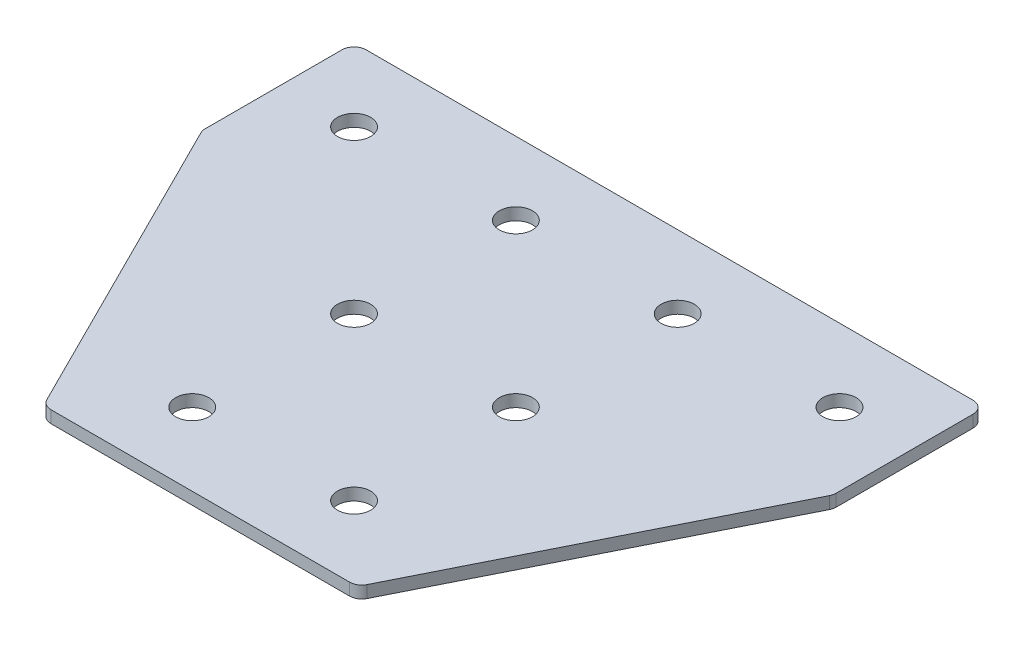
ISO-10303-21;
HEADER;
FILE_DESCRIPTION(('STEP AP214'),'2;1');
FILE_NAME('part.step','',(''),(''),'','','');
FILE_SCHEMA(('AUTOMOTIVE_DESIGN { 1 0 10303 214 1 1 1 1 }'));
ENDSEC;
DATA;
#1=APPLICATION_CONTEXT('core data for automotive mechanical design processes');
#2=APPLICATION_PROTOCOL_DEFINITION('international standard','automotive_design',2000,#1);
#3=PRODUCT_CONTEXT('',#1,'mechanical');
#4=PRODUCT('Part','Part','',(#3));
#5=PRODUCT_RELATED_PRODUCT_CATEGORY('part','',(#4));
#6=PRODUCT_DEFINITION_FORMATION('','',#4);
#7=PRODUCT_DEFINITION_CONTEXT('part definition',#1,'design');
#8=PRODUCT_DEFINITION('design','',#6,#7);
#9=PRODUCT_DEFINITION_SHAPE('','',#8);
#10=(LENGTH_UNIT() NAMED_UNIT(*) SI_UNIT(.MILLI.,.METRE.));
#11=(NAMED_UNIT(*) PLANE_ANGLE_UNIT() SI_UNIT($,.RADIAN.));
#12=(NAMED_UNIT(*) SI_UNIT($,.STERADIAN.) SOLID_ANGLE_UNIT());
#13=UNCERTAINTY_MEASURE_WITH_UNIT(LENGTH_MEASURE(1.E-05),#10,'distance_accuracy_value','');
#14=(GEOMETRIC_REPRESENTATION_CONTEXT(3) GLOBAL_UNCERTAINTY_ASSIGNED_CONTEXT((#13)) GLOBAL_UNIT_ASSIGNED_CONTEXT((#10,
#11,#12)) REPRESENTATION_CONTEXT('',''));
#15=CARTESIAN_POINT('',(0.,0.,0.));
#16=DIRECTION('',(0.,0.,1.));
#17=DIRECTION('',(1.,0.,0.));
#18=AXIS2_PLACEMENT_3D('',#15,#16,#17);
#19=CARTESIAN_POINT('',(0.,0.,0.));
#20=DIRECTION('',(0.,-1.,0.));
#21=DIRECTION('',(0.,0.,-1.));
#22=AXIS2_PLACEMENT_3D('',#19,#20,#21);
#23=PLANE('',#22);
#24=DIRECTION('',(1.,0.,0.));
#25=VECTOR('',#24,1.);
#26=CARTESIAN_POINT('',(-38.0000000000001,0.,98.));
#27=LINE('',#26,#25);
#28=CARTESIAN_POINT('',(-36.9098300562506,0.,98.));
#29=VERTEX_POINT('',#28);
#30=CARTESIAN_POINT('',(36.9098300562506,0.,98.));
#31=VERTEX_POINT('',#30);
#32=EDGE_CURVE('E194',#29,#31,#27,.T.);
#33=ORIENTED_EDGE('',*,*,#32,.F.);
#34=CARTESIAN_POINT('',(-36.9098300562506,0.,95.));
#35=DIRECTION('',(0.,1.,0.));
#36=DIRECTION('',(0.,0.,-1.));
#37=AXIS2_PLACEMENT_3D('',#34,#35,#36);
#38=CIRCLE('',#37,3.);
#39=CARTESIAN_POINT('',(-39.5931116292504,0.,96.3416407864999));
#40=VERTEX_POINT('',#39);
#41=EDGE_CURVE('E154',#40,#29,#38,.T.);
#42=ORIENTED_EDGE('',*,*,#41,.F.);
#43=DIRECTION('',(-0.447213595499956,0.,-0.894427190999917));
#44=VECTOR('',#43,1.);
#45=CARTESIAN_POINT('',(-38.7639320225003,0.,98.));
#46=LINE('',#45,#44);
#47=CARTESIAN_POINT('',(-77.6832815729996,0.,20.1613008990009));
#48=VERTEX_POINT('',#47);
#49=EDGE_CURVE('E141',#40,#48,#46,.T.);
#50=ORIENTED_EDGE('',*,*,#49,.T.);
#51=CARTESIAN_POINT('',(-74.9999999999999,0.,18.8196601125011));
#52=DIRECTION('',(0.,1.,0.));
#53=DIRECTION('',(0.,0.,-1.));
#54=AXIS2_PLACEMENT_3D('',#51,#52,#53);
#55=CIRCLE('',#54,3.);
#56=CARTESIAN_POINT('',(-77.9999999999999,0.,18.8196601125011));
#57=VERTEX_POINT('',#56);
#58=EDGE_CURVE('E152',#57,#48,#55,.T.);
#59=ORIENTED_EDGE('',*,*,#58,.F.);
#60=DIRECTION('',(0.,0.,-1.));
#61=VECTOR('',#60,1.);
#62=CARTESIAN_POINT('',(-77.9999999999999,0.,19.5278640450004));
#63=LINE('',#62,#61);
#64=CARTESIAN_POINT('',(-77.9999999999999,0.,-15.));
#65=VERTEX_POINT('',#64);
#66=EDGE_CURVE('E124',#57,#65,#63,.T.);
#67=ORIENTED_EDGE('',*,*,#66,.T.);
#68=CARTESIAN_POINT('',(-74.9999999999999,0.,-15.));
#69=DIRECTION('',(0.,1.,0.));
#70=DIRECTION('',(0.,0.,-1.));
#71=AXIS2_PLACEMENT_3D('',#68,#69,#70);
#72=CIRCLE('',#71,3.);
#73=CARTESIAN_POINT('',(-74.9999999999999,0.,-18.));
#74=VERTEX_POINT('',#73);
#75=EDGE_CURVE('E149',#74,#65,#72,.T.);
#76=ORIENTED_EDGE('',*,*,#75,.F.);
#77=DIRECTION('',(-1.,0.,0.));
#78=VECTOR('',#77,1.);
#79=CARTESIAN_POINT('',(77.9999999999999,0.,-18.));
#80=LINE('',#79,#78);
#81=CARTESIAN_POINT('',(74.9999999999999,0.,-18.));
#82=VERTEX_POINT('',#81);
#83=EDGE_CURVE('E191',#82,#74,#80,.T.);
#84=ORIENTED_EDGE('',*,*,#83,.F.);
#85=CARTESIAN_POINT('',(74.9999999999999,0.,-15.));
#86=DIRECTION('',(0.,-1.,0.));
#87=DIRECTION('',(0.,0.,-1.));
#88=AXIS2_PLACEMENT_3D('',#85,#86,#87);
#89=CIRCLE('',#88,3.);
#90=CARTESIAN_POINT('',(77.9999999999999,0.,-15.));
#91=VERTEX_POINT('',#90);
#92=EDGE_CURVE('E215',#82,#91,#89,.T.);
#93=ORIENTED_EDGE('',*,*,#92,.T.);
#94=DIRECTION('',(0.,0.,-1.));
#95=VECTOR('',#94,1.);
#96=CARTESIAN_POINT('',(77.9999999999999,0.,19.5278640450004));
#97=LINE('',#96,#95);
#98=CARTESIAN_POINT('',(77.9999999999999,0.,18.819660112501));
#99=VERTEX_POINT('',#98);
#100=EDGE_CURVE('E188',#99,#91,#97,.T.);
#101=ORIENTED_EDGE('',*,*,#100,.F.);
#102=CARTESIAN_POINT('',(74.9999999999999,0.,18.819660112501));
#103=DIRECTION('',(0.,-1.,0.));
#104=DIRECTION('',(0.,0.,-1.));
#105=AXIS2_PLACEMENT_3D('',#102,#103,#104);
#106=CIRCLE('',#105,3.);
#107=CARTESIAN_POINT('',(77.6832815729996,0.,20.1613008990009));
#108=VERTEX_POINT('',#107);
#109=EDGE_CURVE('E31',#99,#108,#106,.T.);
#110=ORIENTED_EDGE('',*,*,#109,.T.);
#111=DIRECTION('',(0.447213595499956,0.,-0.894427190999917));
#112=VECTOR('',#111,1.);
#113=CARTESIAN_POINT('',(38.7639320225003,0.,98.));
#114=LINE('',#113,#112);
#115=CARTESIAN_POINT('',(39.5931116292504,0.,96.3416407864998));
#116=VERTEX_POINT('',#115);
#117=EDGE_CURVE('E196',#116,#108,#114,.T.);
#118=ORIENTED_EDGE('',*,*,#117,.F.);
#119=CARTESIAN_POINT('',(36.9098300562506,0.,95.));
#120=DIRECTION('',(0.,-1.,0.));
#121=DIRECTION('',(0.,0.,-1.));
#122=AXIS2_PLACEMENT_3D('',#119,#120,#121);
#123=CIRCLE('',#122,3.);
#124=EDGE_CURVE('E218',#116,#31,#123,.T.);
#125=ORIENTED_EDGE('',*,*,#124,.T.);
#126=EDGE_LOOP('',(#33,#42,#50,#59,#67,#76,#84,#93,#101,#110,#118,#125));
#127=FACE_BOUND('',#126,.T.);
#128=CARTESIAN_POINT('',(20.,0.,80.));
#129=DIRECTION('',(0.,1.,0.));
#130=DIRECTION('',(0.,0.,1.));
#131=AXIS2_PLACEMENT_3D('',#128,#129,#130);
#132=CIRCLE('',#131,4.1);
#133=CARTESIAN_POINT('',(20.,0.,84.1));
#134=VERTEX_POINT('',#133);
#135=EDGE_CURVE('E164',#134,#134,#132,.T.);
#136=ORIENTED_EDGE('',*,*,#135,.T.);
#137=EDGE_LOOP('',(#136));
#138=FACE_BOUND('',#137,.T.);
#139=CARTESIAN_POINT('',(20.,0.,40.));
#140=DIRECTION('',(0.,1.,0.));
#141=DIRECTION('',(0.,0.,1.));
#142=AXIS2_PLACEMENT_3D('',#139,#140,#141);
#143=CIRCLE('',#142,4.1);
#144=CARTESIAN_POINT('',(20.,0.,44.1));
#145=VERTEX_POINT('',#144);
#146=EDGE_CURVE('E170',#145,#145,#143,.T.);
#147=ORIENTED_EDGE('',*,*,#146,.T.);
#148=EDGE_LOOP('',(#147));
#149=FACE_BOUND('',#148,.T.);
#150=CARTESIAN_POINT('',(60.,0.,0.));
#151=DIRECTION('',(0.,1.,0.));
#152=DIRECTION('',(0.,0.,1.));
#153=AXIS2_PLACEMENT_3D('',#150,#151,#152);
#154=CIRCLE('',#153,4.09999999999999);
#155=CARTESIAN_POINT('',(60.,0.,4.1));
#156=VERTEX_POINT('',#155);
#157=EDGE_CURVE('E176',#156,#156,#154,.T.);
#158=ORIENTED_EDGE('',*,*,#157,.T.);
#159=EDGE_LOOP('',(#158));
#160=FACE_BOUND('',#159,.T.);
#161=CARTESIAN_POINT('',(20.,0.,0.));
#162=DIRECTION('',(0.,1.,0.));
#163=DIRECTION('',(0.,0.,1.));
#164=AXIS2_PLACEMENT_3D('',#161,#162,#163);
#165=CIRCLE('',#164,4.1);
#166=CARTESIAN_POINT('',(20.,0.,4.10000000000001));
#167=VERTEX_POINT('',#166);
#168=EDGE_CURVE('E182',#167,#167,#165,.T.);
#169=ORIENTED_EDGE('',*,*,#168,.T.);
#170=EDGE_LOOP('',(#169));
#171=FACE_BOUND('',#170,.T.);
#172=CARTESIAN_POINT('',(-20.,0.,80.));
#173=DIRECTION('',(0.,-1.,0.));
#174=DIRECTION('',(0.,0.,1.));
#175=AXIS2_PLACEMENT_3D('',#172,#173,#174);
#176=CIRCLE('',#175,4.1);
#177=CARTESIAN_POINT('',(-20.,0.,84.1));
#178=VERTEX_POINT('',#177);
#179=EDGE_CURVE('E270',#178,#178,#176,.T.);
#180=ORIENTED_EDGE('',*,*,#179,.F.);
#181=EDGE_LOOP('',(#180));
#182=FACE_BOUND('',#181,.T.);
#183=CARTESIAN_POINT('',(-20.,0.,40.));
#184=DIRECTION('',(0.,-1.,0.));
#185=DIRECTION('',(0.,0.,1.));
#186=AXIS2_PLACEMENT_3D('',#183,#184,#185);
#187=CIRCLE('',#186,4.1);
#188=CARTESIAN_POINT('',(-20.,0.,44.1));
#189=VERTEX_POINT('',#188);
#190=EDGE_CURVE('E264',#189,#189,#187,.T.);
#191=ORIENTED_EDGE('',*,*,#190,.F.);
#192=EDGE_LOOP('',(#191));
#193=FACE_BOUND('',#192,.T.);
#194=CARTESIAN_POINT('',(-60.,0.,0.));
#195=DIRECTION('',(0.,-1.,0.));
#196=DIRECTION('',(0.,0.,1.));
#197=AXIS2_PLACEMENT_3D('',#194,#195,#196);
#198=CIRCLE('',#197,4.09999999999999);
#199=CARTESIAN_POINT('',(-60.,0.,4.10000000000001));
#200=VERTEX_POINT('',#199);
#201=EDGE_CURVE('E259',#200,#200,#198,.T.);
#202=ORIENTED_EDGE('',*,*,#201,.F.);
#203=EDGE_LOOP('',(#202));
#204=FACE_BOUND('',#203,.T.);
#205=CARTESIAN_POINT('',(-20.,0.,0.));
#206=DIRECTION('',(0.,-1.,0.));
#207=DIRECTION('',(0.,0.,1.));
#208=AXIS2_PLACEMENT_3D('',#205,#206,#207);
#209=CIRCLE('',#208,4.1);
#210=CARTESIAN_POINT('',(-20.,0.,4.10000000000001));
#211=VERTEX_POINT('',#210);
#212=EDGE_CURVE('E134',#211,#211,#209,.T.);
#213=ORIENTED_EDGE('',*,*,#212,.F.);
#214=EDGE_LOOP('',(#213));
#215=FACE_BOUND('',#214,.T.);
#216=ADVANCED_FACE('F16',(#127,#138,#149,#160,#171,#182,#193,#204,#215),#23,.T.);
#217=CARTESIAN_POINT('',(77.9999999999999,0.,19.5278640450004));
#218=DIRECTION('',(1.,0.,0.));
#219=DIRECTION('',(0.,0.,-1.));
#220=AXIS2_PLACEMENT_3D('',#217,#218,#219);
#221=PLANE('',#220);
#222=DIRECTION('',(0.,0.,-1.));
#223=VECTOR('',#222,1.);
#224=CARTESIAN_POINT('',(77.9999999999999,3.,19.5278640450004));
#225=LINE('',#224,#223);
#226=CARTESIAN_POINT('',(77.9999999999999,3.,18.819660112501));
#227=VERTEX_POINT('',#226);
#228=CARTESIAN_POINT('',(77.9999999999999,3.,-15.));
#229=VERTEX_POINT('',#228);
#230=EDGE_CURVE('E185',#227,#229,#225,.T.);
#231=ORIENTED_EDGE('',*,*,#230,.F.);
#232=DIRECTION('',(0.,1.,0.));
#233=VECTOR('',#232,1.);
#234=CARTESIAN_POINT('',(77.9999999999999,0.,18.819660112501));
#235=LINE('',#234,#233);
#236=EDGE_CURVE('E24',#227,#99,#235,.F.);
#237=ORIENTED_EDGE('',*,*,#236,.T.);
#238=ORIENTED_EDGE('',*,*,#100,.T.);
#239=DIRECTION('',(0.,1.,0.));
#240=VECTOR('',#239,1.);
#241=CARTESIAN_POINT('',(77.9999999999999,0.,-15.));
#242=LINE('',#241,#240);
#243=EDGE_CURVE('E225',#91,#229,#242,.T.);
#244=ORIENTED_EDGE('',*,*,#243,.T.);
#245=EDGE_LOOP('',(#231,#237,#238,#244));
#246=FACE_BOUND('',#245,.T.);
#247=ADVANCED_FACE('F230',(#246),#221,.T.);
#248=CARTESIAN_POINT('',(38.7639320225003,0.,98.));
#249=DIRECTION('',(0.894427190999917,0.,0.447213595499956));
#250=DIRECTION('',(0.447213595499956,0.,-0.894427190999917));
#251=AXIS2_PLACEMENT_3D('',#248,#249,#250);
#252=PLANE('',#251);
#253=DIRECTION('',(0.447213595499956,0.,-0.894427190999917));
#254=VECTOR('',#253,1.);
#255=CARTESIAN_POINT('',(38.7639320225003,3.,98.));
#256=LINE('',#255,#254);
#257=CARTESIAN_POINT('',(39.5931116292504,3.,96.3416407864998));
#258=VERTEX_POINT('',#257);
#259=CARTESIAN_POINT('',(77.6832815729996,3.,20.1613008990009));
#260=VERTEX_POINT('',#259);
#261=EDGE_CURVE('E192',#258,#260,#256,.T.);
#262=ORIENTED_EDGE('',*,*,#261,.F.);
#263=DIRECTION('',(0.,1.,0.));
#264=VECTOR('',#263,1.);
#265=CARTESIAN_POINT('',(39.5931116292504,0.,96.3416407864998));
#266=LINE('',#265,#264);
#267=EDGE_CURVE('E38',#258,#116,#266,.F.);
#268=ORIENTED_EDGE('',*,*,#267,.T.);
#269=ORIENTED_EDGE('',*,*,#117,.T.);
#270=DIRECTION('',(0.,1.,0.));
#271=VECTOR('',#270,1.);
#272=CARTESIAN_POINT('',(77.6832815729996,0.,20.1613008990009));
#273=LINE('',#272,#271);
#274=EDGE_CURVE('E221',#108,#260,#273,.T.);
#275=ORIENTED_EDGE('',*,*,#274,.T.);
#276=EDGE_LOOP('',(#262,#268,#269,#275));
#277=FACE_BOUND('',#276,.T.);
#278=ADVANCED_FACE('F238',(#277),#252,.T.);
#279=CARTESIAN_POINT('',(-38.0000000000001,0.,98.));
#280=DIRECTION('',(0.,0.,1.));
#281=DIRECTION('',(1.,0.,0.));
#282=AXIS2_PLACEMENT_3D('',#279,#280,#281);
#283=PLANE('',#282);
#284=DIRECTION('',(1.,0.,0.));
#285=VECTOR('',#284,1.);
#286=CARTESIAN_POINT('',(-38.0000000000001,3.,98.));
#287=LINE('',#286,#285);
#288=CARTESIAN_POINT('',(-36.9098300562506,3.,98.));
#289=VERTEX_POINT('',#288);
#290=CARTESIAN_POINT('',(36.9098300562506,3.,98.));
#291=VERTEX_POINT('',#290);
#292=EDGE_CURVE('E203',#289,#291,#287,.T.);
#293=ORIENTED_EDGE('',*,*,#292,.F.);
#294=DIRECTION('',(0.,1.,0.));
#295=VECTOR('',#294,1.);
#296=CARTESIAN_POINT('',(-36.9098300562506,0.,98.));
#297=LINE('',#296,#295);
#298=EDGE_CURVE('E146',#29,#289,#297,.T.);
#299=ORIENTED_EDGE('',*,*,#298,.F.);
#300=ORIENTED_EDGE('',*,*,#32,.T.);
#301=DIRECTION('',(0.,1.,0.));
#302=VECTOR('',#301,1.);
#303=CARTESIAN_POINT('',(36.9098300562506,0.,98.));
#304=LINE('',#303,#302);
#305=EDGE_CURVE('E212',#31,#291,#304,.T.);
#306=ORIENTED_EDGE('',*,*,#305,.T.);
#307=EDGE_LOOP('',(#293,#299,#300,#306));
#308=FACE_BOUND('',#307,.T.);
#309=ADVANCED_FACE('F246',(#308),#283,.T.);
#310=CARTESIAN_POINT('',(77.9999999999999,0.,-18.));
#311=DIRECTION('',(0.,0.,-1.));
#312=DIRECTION('',(-1.,0.,0.));
#313=AXIS2_PLACEMENT_3D('',#310,#311,#312);
#314=PLANE('',#313);
#315=ORIENTED_EDGE('',*,*,#83,.T.);
#316=DIRECTION('',(0.,1.,0.));
#317=VECTOR('',#316,1.);
#318=CARTESIAN_POINT('',(-74.9999999999999,0.,-18.));
#319=LINE('',#318,#317);
#320=CARTESIAN_POINT('',(-74.9999999999999,3.,-18.));
#321=VERTEX_POINT('',#320);
#322=EDGE_CURVE('E126',#321,#74,#319,.F.);
#323=ORIENTED_EDGE('',*,*,#322,.F.);
#324=DIRECTION('',(-1.,0.,0.));
#325=VECTOR('',#324,1.);
#326=CARTESIAN_POINT('',(77.9999999999999,3.,-18.));
#327=LINE('',#326,#325);
#328=CARTESIAN_POINT('',(74.9999999999999,3.,-18.));
#329=VERTEX_POINT('',#328);
#330=EDGE_CURVE('E201',#329,#321,#327,.T.);
#331=ORIENTED_EDGE('',*,*,#330,.F.);
#332=DIRECTION('',(0.,1.,0.));
#333=VECTOR('',#332,1.);
#334=CARTESIAN_POINT('',(74.9999999999999,0.,-18.));
#335=LINE('',#334,#333);
#336=EDGE_CURVE('E10',#329,#82,#335,.F.);
#337=ORIENTED_EDGE('',*,*,#336,.T.);
#338=EDGE_LOOP('',(#315,#323,#331,#337));
#339=FACE_BOUND('',#338,.T.);
#340=ADVANCED_FACE('F300',(#339),#314,.T.);
#341=CARTESIAN_POINT('',(0.,3.,0.));
#342=DIRECTION('',(0.,-1.,0.));
#343=DIRECTION('',(0.,0.,-1.));
#344=AXIS2_PLACEMENT_3D('',#341,#342,#343);
#345=PLANE('',#344);
#346=CARTESIAN_POINT('',(20.,3.,80.));
#347=DIRECTION('',(0.,1.,0.));
#348=DIRECTION('',(0.,0.,1.));
#349=AXIS2_PLACEMENT_3D('',#346,#347,#348);
#350=CIRCLE('',#349,4.1);
#351=CARTESIAN_POINT('',(20.,3.,84.1));
#352=VERTEX_POINT('',#351);
#353=EDGE_CURVE('E163',#352,#352,#350,.T.);
#354=ORIENTED_EDGE('',*,*,#353,.F.);
#355=EDGE_LOOP('',(#354));
#356=FACE_BOUND('',#355,.T.);
#357=CARTESIAN_POINT('',(20.,3.,40.));
#358=DIRECTION('',(0.,1.,0.));
#359=DIRECTION('',(0.,0.,1.));
#360=AXIS2_PLACEMENT_3D('',#357,#358,#359);
#361=CIRCLE('',#360,4.1);
#362=CARTESIAN_POINT('',(20.,3.,44.1));
#363=VERTEX_POINT('',#362);
#364=EDGE_CURVE('E167',#363,#363,#361,.T.);
#365=ORIENTED_EDGE('',*,*,#364,.F.);
#366=EDGE_LOOP('',(#365));
#367=FACE_BOUND('',#366,.T.);
#368=CARTESIAN_POINT('',(60.,3.,0.));
#369=DIRECTION('',(0.,1.,0.));
#370=DIRECTION('',(0.,0.,1.));
#371=AXIS2_PLACEMENT_3D('',#368,#369,#370);
#372=CIRCLE('',#371,4.09999999999999);
#373=CARTESIAN_POINT('',(60.,3.,4.1));
#374=VERTEX_POINT('',#373);
#375=EDGE_CURVE('E173',#374,#374,#372,.T.);
#376=ORIENTED_EDGE('',*,*,#375,.F.);
#377=EDGE_LOOP('',(#376));
#378=FACE_BOUND('',#377,.T.);
#379=CARTESIAN_POINT('',(20.,3.,0.));
#380=DIRECTION('',(0.,1.,0.));
#381=DIRECTION('',(0.,0.,1.));
#382=AXIS2_PLACEMENT_3D('',#379,#380,#381);
#383=CIRCLE('',#382,4.1);
#384=CARTESIAN_POINT('',(20.,3.,4.10000000000001));
#385=VERTEX_POINT('',#384);
#386=EDGE_CURVE('E179',#385,#385,#383,.T.);
#387=ORIENTED_EDGE('',*,*,#386,.F.);
#388=EDGE_LOOP('',(#387));
#389=FACE_BOUND('',#388,.T.);
#390=ORIENTED_EDGE('',*,*,#330,.T.);
#391=CARTESIAN_POINT('',(-74.9999999999999,3.,-15.));
#392=DIRECTION('',(0.,1.,0.));
#393=DIRECTION('',(0.,0.,-1.));
#394=AXIS2_PLACEMENT_3D('',#391,#392,#393);
#395=CIRCLE('',#394,3.);
#396=CARTESIAN_POINT('',(-77.9999999999999,3.,-15.));
#397=VERTEX_POINT('',#396);
#398=EDGE_CURVE('E117',#397,#321,#395,.F.);
#399=ORIENTED_EDGE('',*,*,#398,.F.);
#400=DIRECTION('',(0.,0.,-1.));
#401=VECTOR('',#400,1.);
#402=CARTESIAN_POINT('',(-77.9999999999999,3.,19.5278640450004));
#403=LINE('',#402,#401);
#404=CARTESIAN_POINT('',(-77.9999999999999,3.,18.8196601125011));
#405=VERTEX_POINT('',#404);
#406=EDGE_CURVE('E122',#405,#397,#403,.T.);
#407=ORIENTED_EDGE('',*,*,#406,.F.);
#408=CARTESIAN_POINT('',(-74.9999999999999,3.,18.8196601125011));
#409=DIRECTION('',(0.,1.,0.));
#410=DIRECTION('',(0.,0.,-1.));
#411=AXIS2_PLACEMENT_3D('',#408,#409,#410);
#412=CIRCLE('',#411,3.);
#413=CARTESIAN_POINT('',(-77.6832815729996,3.,20.1613008990009));
#414=VERTEX_POINT('',#413);
#415=EDGE_CURVE('E105',#414,#405,#412,.F.);
#416=ORIENTED_EDGE('',*,*,#415,.F.);
#417=DIRECTION('',(-0.447213595499956,0.,-0.894427190999917));
#418=VECTOR('',#417,1.);
#419=CARTESIAN_POINT('',(-38.7639320225003,3.,98.));
#420=LINE('',#419,#418);
#421=CARTESIAN_POINT('',(-39.5931116292504,3.,96.3416407864999));
#422=VERTEX_POINT('',#421);
#423=EDGE_CURVE('E133',#422,#414,#420,.T.);
#424=ORIENTED_EDGE('',*,*,#423,.F.);
#425=CARTESIAN_POINT('',(-36.9098300562506,3.,95.));
#426=DIRECTION('',(0.,1.,0.));
#427=DIRECTION('',(0.,0.,-1.));
#428=AXIS2_PLACEMENT_3D('',#425,#426,#427);
#429=CIRCLE('',#428,3.);
#430=EDGE_CURVE('E116',#289,#422,#429,.F.);
#431=ORIENTED_EDGE('',*,*,#430,.F.);
#432=ORIENTED_EDGE('',*,*,#292,.T.);
#433=CARTESIAN_POINT('',(36.9098300562506,3.,95.));
#434=DIRECTION('',(0.,-1.,0.));
#435=DIRECTION('',(0.,0.,-1.));
#436=AXIS2_PLACEMENT_3D('',#433,#434,#435);
#437=CIRCLE('',#436,3.);
#438=EDGE_CURVE('E210',#291,#258,#437,.F.);
#439=ORIENTED_EDGE('',*,*,#438,.T.);
#440=ORIENTED_EDGE('',*,*,#261,.T.);
#441=CARTESIAN_POINT('',(74.9999999999999,3.,18.819660112501));
#442=DIRECTION('',(0.,-1.,0.));
#443=DIRECTION('',(0.,0.,-1.));
#444=AXIS2_PLACEMENT_3D('',#441,#442,#443);
#445=CIRCLE('',#444,3.);
#446=EDGE_CURVE('E208',#260,#227,#445,.F.);
#447=ORIENTED_EDGE('',*,*,#446,.T.);
#448=ORIENTED_EDGE('',*,*,#230,.T.);
#449=CARTESIAN_POINT('',(74.9999999999999,3.,-15.));
#450=DIRECTION('',(0.,-1.,0.));
#451=DIRECTION('',(0.,0.,-1.));
#452=AXIS2_PLACEMENT_3D('',#449,#450,#451);
#453=CIRCLE('',#452,3.);
#454=EDGE_CURVE('E198',#229,#329,#453,.F.);
#455=ORIENTED_EDGE('',*,*,#454,.T.);
#456=EDGE_LOOP('',(#390,#399,#407,#416,#424,#431,#432,#439,#440,#447,#448,#455));
#457=FACE_BOUND('',#456,.T.);
#458=CARTESIAN_POINT('',(-20.,3.,80.));
#459=DIRECTION('',(0.,-1.,0.));
#460=DIRECTION('',(0.,0.,1.));
#461=AXIS2_PLACEMENT_3D('',#458,#459,#460);
#462=CIRCLE('',#461,4.1);
#463=CARTESIAN_POINT('',(-20.,3.,84.1));
#464=VERTEX_POINT('',#463);
#465=EDGE_CURVE('E273',#464,#464,#462,.T.);
#466=ORIENTED_EDGE('',*,*,#465,.T.);
#467=EDGE_LOOP('',(#466));
#468=FACE_BOUND('',#467,.T.);
#469=CARTESIAN_POINT('',(-20.,3.,40.));
#470=DIRECTION('',(0.,-1.,0.));
#471=DIRECTION('',(0.,0.,1.));
#472=AXIS2_PLACEMENT_3D('',#469,#470,#471);
#473=CIRCLE('',#472,4.1);
#474=CARTESIAN_POINT('',(-20.,3.,44.1));
#475=VERTEX_POINT('',#474);
#476=EDGE_CURVE('E267',#475,#475,#473,.T.);
#477=ORIENTED_EDGE('',*,*,#476,.T.);
#478=EDGE_LOOP('',(#477));
#479=FACE_BOUND('',#478,.T.);
#480=CARTESIAN_POINT('',(-60.,3.,0.));
#481=DIRECTION('',(0.,-1.,0.));
#482=DIRECTION('',(0.,0.,1.));
#483=AXIS2_PLACEMENT_3D('',#480,#481,#482);
#484=CIRCLE('',#483,4.09999999999999);
#485=CARTESIAN_POINT('',(-60.,3.,4.10000000000001));
#486=VERTEX_POINT('',#485);
#487=EDGE_CURVE('E261',#486,#486,#484,.T.);
#488=ORIENTED_EDGE('',*,*,#487,.T.);
#489=EDGE_LOOP('',(#488));
#490=FACE_BOUND('',#489,.T.);
#491=CARTESIAN_POINT('',(-20.,3.,0.));
#492=DIRECTION('',(0.,-1.,0.));
#493=DIRECTION('',(0.,0.,1.));
#494=AXIS2_PLACEMENT_3D('',#491,#492,#493);
#495=CIRCLE('',#494,4.1);
#496=CARTESIAN_POINT('',(-20.,3.,4.10000000000001));
#497=VERTEX_POINT('',#496);
#498=EDGE_CURVE('E138',#497,#497,#495,.T.);
#499=ORIENTED_EDGE('',*,*,#498,.T.);
#500=EDGE_LOOP('',(#499));
#501=FACE_BOUND('',#500,.T.);
#502=ADVANCED_FACE('F129',(#356,#367,#378,#389,#457,#468,#479,#490,#501),#345,.F.);
#503=CARTESIAN_POINT('',(36.9098300562506,0.,95.));
#504=DIRECTION('',(0.,1.,0.));
#505=DIRECTION('',(0.,0.,1.));
#506=AXIS2_PLACEMENT_3D('',#503,#504,#505);
#507=CYLINDRICAL_SURFACE('',#506,3.);
#508=ORIENTED_EDGE('',*,*,#124,.F.);
#509=ORIENTED_EDGE('',*,*,#267,.F.);
#510=ORIENTED_EDGE('',*,*,#438,.F.);
#511=ORIENTED_EDGE('',*,*,#305,.F.);
#512=EDGE_LOOP('',(#508,#509,#510,#511));
#513=FACE_BOUND('',#512,.T.);
#514=ADVANCED_FACE('F244',(#513),#507,.T.);
#515=CARTESIAN_POINT('',(74.9999999999999,0.,18.819660112501));
#516=DIRECTION('',(0.,1.,0.));
#517=DIRECTION('',(0.,0.,1.));
#518=AXIS2_PLACEMENT_3D('',#515,#516,#517);
#519=CYLINDRICAL_SURFACE('',#518,3.);
#520=ORIENTED_EDGE('',*,*,#109,.F.);
#521=ORIENTED_EDGE('',*,*,#236,.F.);
#522=ORIENTED_EDGE('',*,*,#446,.F.);
#523=ORIENTED_EDGE('',*,*,#274,.F.);
#524=EDGE_LOOP('',(#520,#521,#522,#523));
#525=FACE_BOUND('',#524,.T.);
#526=ADVANCED_FACE('F237',(#525),#519,.T.);
#527=CARTESIAN_POINT('',(74.9999999999999,0.,-15.));
#528=DIRECTION('',(0.,1.,0.));
#529=DIRECTION('',(0.,0.,1.));
#530=AXIS2_PLACEMENT_3D('',#527,#528,#529);
#531=CYLINDRICAL_SURFACE('',#530,3.);
#532=ORIENTED_EDGE('',*,*,#92,.F.);
#533=ORIENTED_EDGE('',*,*,#336,.F.);
#534=ORIENTED_EDGE('',*,*,#454,.F.);
#535=ORIENTED_EDGE('',*,*,#243,.F.);
#536=EDGE_LOOP('',(#532,#533,#534,#535));
#537=FACE_BOUND('',#536,.T.);
#538=ADVANCED_FACE('F18',(#537),#531,.T.);
#539=CARTESIAN_POINT('',(20.,0.,0.));
#540=DIRECTION('',(0.,1.,0.));
#541=DIRECTION('',(0.,0.,1.));
#542=AXIS2_PLACEMENT_3D('',#539,#540,#541);
#543=CYLINDRICAL_SURFACE('',#542,4.1);
#544=ORIENTED_EDGE('',*,*,#168,.F.);
#545=EDGE_LOOP('',(#544));
#546=FACE_BOUND('',#545,.T.);
#547=ORIENTED_EDGE('',*,*,#386,.T.);
#548=EDGE_LOOP('',(#547));
#549=FACE_BOUND('',#548,.T.);
#550=ADVANCED_FACE('F318',(#546,#549),#543,.F.);
#551=CARTESIAN_POINT('',(60.,0.,0.));
#552=DIRECTION('',(0.,1.,0.));
#553=DIRECTION('',(0.,0.,1.));
#554=AXIS2_PLACEMENT_3D('',#551,#552,#553);
#555=CYLINDRICAL_SURFACE('',#554,4.09999999999999);
#556=ORIENTED_EDGE('',*,*,#157,.F.);
#557=EDGE_LOOP('',(#556));
#558=FACE_BOUND('',#557,.T.);
#559=ORIENTED_EDGE('',*,*,#375,.T.);
#560=EDGE_LOOP('',(#559));
#561=FACE_BOUND('',#560,.T.);
#562=ADVANCED_FACE('F323',(#558,#561),#555,.F.);
#563=CARTESIAN_POINT('',(20.,0.,40.));
#564=DIRECTION('',(0.,1.,0.));
#565=DIRECTION('',(0.,0.,1.));
#566=AXIS2_PLACEMENT_3D('',#563,#564,#565);
#567=CYLINDRICAL_SURFACE('',#566,4.1);
#568=ORIENTED_EDGE('',*,*,#146,.F.);
#569=EDGE_LOOP('',(#568));
#570=FACE_BOUND('',#569,.T.);
#571=ORIENTED_EDGE('',*,*,#364,.T.);
#572=EDGE_LOOP('',(#571));
#573=FACE_BOUND('',#572,.T.);
#574=ADVANCED_FACE('F341',(#570,#573),#567,.F.);
#575=CARTESIAN_POINT('',(20.,0.,80.));
#576=DIRECTION('',(0.,1.,0.));
#577=DIRECTION('',(0.,0.,1.));
#578=AXIS2_PLACEMENT_3D('',#575,#576,#577);
#579=CYLINDRICAL_SURFACE('',#578,4.1);
#580=ORIENTED_EDGE('',*,*,#135,.F.);
#581=EDGE_LOOP('',(#580));
#582=FACE_BOUND('',#581,.T.);
#583=ORIENTED_EDGE('',*,*,#353,.T.);
#584=EDGE_LOOP('',(#583));
#585=FACE_BOUND('',#584,.T.);
#586=ADVANCED_FACE('F338',(#582,#585),#579,.F.);
#587=CARTESIAN_POINT('',(-77.9999999999999,0.,19.5278640450004));
#588=DIRECTION('',(-1.,0.,0.));
#589=DIRECTION('',(0.,0.,-1.));
#590=AXIS2_PLACEMENT_3D('',#587,#588,#589);
#591=PLANE('',#590);
#592=ORIENTED_EDGE('',*,*,#406,.T.);
#593=DIRECTION('',(0.,1.,0.));
#594=VECTOR('',#593,1.);
#595=CARTESIAN_POINT('',(-77.9999999999999,0.,-15.));
#596=LINE('',#595,#594);
#597=EDGE_CURVE('E127',#65,#397,#596,.T.);
#598=ORIENTED_EDGE('',*,*,#597,.F.);
#599=ORIENTED_EDGE('',*,*,#66,.F.);
#600=DIRECTION('',(0.,1.,0.));
#601=VECTOR('',#600,1.);
#602=CARTESIAN_POINT('',(-77.9999999999999,0.,18.8196601125011));
#603=LINE('',#602,#601);
#604=EDGE_CURVE('E109',#405,#57,#603,.F.);
#605=ORIENTED_EDGE('',*,*,#604,.F.);
#606=EDGE_LOOP('',(#592,#598,#599,#605));
#607=FACE_BOUND('',#606,.T.);
#608=ADVANCED_FACE('F121',(#607),#591,.T.);
#609=CARTESIAN_POINT('',(-38.7639320225003,0.,98.));
#610=DIRECTION('',(-0.894427190999917,0.,0.447213595499956));
#611=DIRECTION('',(-0.447213595499956,0.,-0.894427190999917));
#612=AXIS2_PLACEMENT_3D('',#609,#610,#611);
#613=PLANE('',#612);
#614=ORIENTED_EDGE('',*,*,#423,.T.);
#615=DIRECTION('',(0.,1.,0.));
#616=VECTOR('',#615,1.);
#617=CARTESIAN_POINT('',(-77.6832815729996,0.,20.1613008990009));
#618=LINE('',#617,#616);
#619=EDGE_CURVE('E111',#48,#414,#618,.T.);
#620=ORIENTED_EDGE('',*,*,#619,.F.);
#621=ORIENTED_EDGE('',*,*,#49,.F.);
#622=DIRECTION('',(0.,1.,0.));
#623=VECTOR('',#622,1.);
#624=CARTESIAN_POINT('',(-39.5931116292504,0.,96.3416407864999));
#625=LINE('',#624,#623);
#626=EDGE_CURVE('E158',#422,#40,#625,.F.);
#627=ORIENTED_EDGE('',*,*,#626,.F.);
#628=EDGE_LOOP('',(#614,#620,#621,#627));
#629=FACE_BOUND('',#628,.T.);
#630=ADVANCED_FACE('F255',(#629),#613,.T.);
#631=CARTESIAN_POINT('',(-36.9098300562506,0.,95.));
#632=DIRECTION('',(0.,1.,0.));
#633=DIRECTION('',(0.,0.,1.));
#634=AXIS2_PLACEMENT_3D('',#631,#632,#633);
#635=CYLINDRICAL_SURFACE('',#634,3.);
#636=ORIENTED_EDGE('',*,*,#41,.T.);
#637=ORIENTED_EDGE('',*,*,#298,.T.);
#638=ORIENTED_EDGE('',*,*,#430,.T.);
#639=ORIENTED_EDGE('',*,*,#626,.T.);
#640=EDGE_LOOP('',(#636,#637,#638,#639));
#641=FACE_BOUND('',#640,.T.);
#642=ADVANCED_FACE('F252',(#641),#635,.T.);
#643=CARTESIAN_POINT('',(-74.9999999999999,0.,18.8196601125011));
#644=DIRECTION('',(0.,1.,0.));
#645=DIRECTION('',(0.,0.,1.));
#646=AXIS2_PLACEMENT_3D('',#643,#644,#645);
#647=CYLINDRICAL_SURFACE('',#646,3.);
#648=ORIENTED_EDGE('',*,*,#58,.T.);
#649=ORIENTED_EDGE('',*,*,#619,.T.);
#650=ORIENTED_EDGE('',*,*,#415,.T.);
#651=ORIENTED_EDGE('',*,*,#604,.T.);
#652=EDGE_LOOP('',(#648,#649,#650,#651));
#653=FACE_BOUND('',#652,.T.);
#654=ADVANCED_FACE('F108',(#653),#647,.T.);
#655=CARTESIAN_POINT('',(-74.9999999999999,0.,-15.));
#656=DIRECTION('',(0.,1.,0.));
#657=DIRECTION('',(0.,0.,1.));
#658=AXIS2_PLACEMENT_3D('',#655,#656,#657);
#659=CYLINDRICAL_SURFACE('',#658,3.);
#660=ORIENTED_EDGE('',*,*,#75,.T.);
#661=ORIENTED_EDGE('',*,*,#597,.T.);
#662=ORIENTED_EDGE('',*,*,#398,.T.);
#663=ORIENTED_EDGE('',*,*,#322,.T.);
#664=EDGE_LOOP('',(#660,#661,#662,#663));
#665=FACE_BOUND('',#664,.T.);
#666=ADVANCED_FACE('F295',(#665),#659,.T.);
#667=CARTESIAN_POINT('',(-20.,0.,0.));
#668=DIRECTION('',(0.,1.,0.));
#669=DIRECTION('',(0.,0.,1.));
#670=AXIS2_PLACEMENT_3D('',#667,#668,#669);
#671=CYLINDRICAL_SURFACE('',#670,4.1);
#672=ORIENTED_EDGE('',*,*,#212,.T.);
#673=EDGE_LOOP('',(#672));
#674=FACE_BOUND('',#673,.T.);
#675=ORIENTED_EDGE('',*,*,#498,.F.);
#676=EDGE_LOOP('',(#675));
#677=FACE_BOUND('',#676,.T.);
#678=ADVANCED_FACE('F291',(#674,#677),#671,.F.);
#679=CARTESIAN_POINT('',(-60.,0.,0.));
#680=DIRECTION('',(0.,1.,0.));
#681=DIRECTION('',(0.,0.,1.));
#682=AXIS2_PLACEMENT_3D('',#679,#680,#681);
#683=CYLINDRICAL_SURFACE('',#682,4.09999999999999);
#684=ORIENTED_EDGE('',*,*,#201,.T.);
#685=EDGE_LOOP('',(#684));
#686=FACE_BOUND('',#685,.T.);
#687=ORIENTED_EDGE('',*,*,#487,.F.);
#688=EDGE_LOOP('',(#687));
#689=FACE_BOUND('',#688,.T.);
#690=ADVANCED_FACE('F294',(#686,#689),#683,.F.);
#691=CARTESIAN_POINT('',(-20.,0.,40.));
#692=DIRECTION('',(0.,1.,0.));
#693=DIRECTION('',(0.,0.,1.));
#694=AXIS2_PLACEMENT_3D('',#691,#692,#693);
#695=CYLINDRICAL_SURFACE('',#694,4.1);
#696=ORIENTED_EDGE('',*,*,#190,.T.);
#697=EDGE_LOOP('',(#696));
#698=FACE_BOUND('',#697,.T.);
#699=ORIENTED_EDGE('',*,*,#476,.F.);
#700=EDGE_LOOP('',(#699));
#701=FACE_BOUND('',#700,.T.);
#702=ADVANCED_FACE('F460',(#698,#701),#695,.F.);
#703=CARTESIAN_POINT('',(-20.,0.,80.));
#704=DIRECTION('',(0.,1.,0.));
#705=DIRECTION('',(0.,0.,1.));
#706=AXIS2_PLACEMENT_3D('',#703,#704,#705);
#707=CYLINDRICAL_SURFACE('',#706,4.1);
#708=ORIENTED_EDGE('',*,*,#179,.T.);
#709=EDGE_LOOP('',(#708));
#710=FACE_BOUND('',#709,.T.);
#711=ORIENTED_EDGE('',*,*,#465,.F.);
#712=EDGE_LOOP('',(#711));
#713=FACE_BOUND('',#712,.T.);
#714=ADVANCED_FACE('F279',(#710,#713),#707,.F.);
#715=CLOSED_SHELL('',(#216,#247,#278,#309,#340,#502,#514,#526,#538,#550,#562,#574,#586,#608,
#630,#642,#654,#666,#678,#690,#702,#714));
#716=MANIFOLD_SOLID_BREP('B1',#715);
#717=ADVANCED_BREP_SHAPE_REPRESENTATION('',(#18,#716),#14);
#718=SHAPE_DEFINITION_REPRESENTATION(#9,#717);
ENDSEC;
END-ISO-10303-21;
